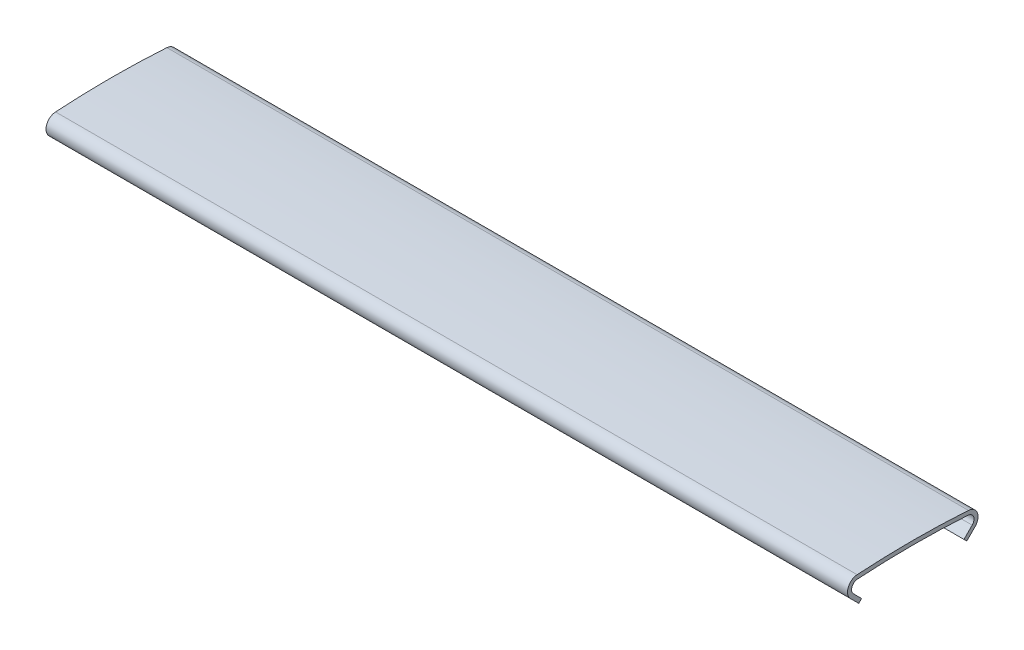
ISO-10303-21;
HEADER;
FILE_DESCRIPTION(('STEP AP214'),'2;1');
FILE_NAME('part.step','',(''),(''),'','','');
FILE_SCHEMA(('AUTOMOTIVE_DESIGN { 1 0 10303 214 1 1 1 1 }'));
ENDSEC;
DATA;
#1=APPLICATION_CONTEXT('core data for automotive mechanical design processes');
#2=APPLICATION_PROTOCOL_DEFINITION('international standard','automotive_design',2000,#1);
#3=PRODUCT_CONTEXT('',#1,'mechanical');
#4=PRODUCT('Part','Part','',(#3));
#5=PRODUCT_RELATED_PRODUCT_CATEGORY('part','',(#4));
#6=PRODUCT_DEFINITION_FORMATION('','',#4);
#7=PRODUCT_DEFINITION_CONTEXT('part definition',#1,'design');
#8=PRODUCT_DEFINITION('design','',#6,#7);
#9=PRODUCT_DEFINITION_SHAPE('','',#8);
#10=(LENGTH_UNIT() NAMED_UNIT(*) SI_UNIT(.MILLI.,.METRE.));
#11=(NAMED_UNIT(*) PLANE_ANGLE_UNIT() SI_UNIT($,.RADIAN.));
#12=(NAMED_UNIT(*) SI_UNIT($,.STERADIAN.) SOLID_ANGLE_UNIT());
#13=UNCERTAINTY_MEASURE_WITH_UNIT(LENGTH_MEASURE(1.E-05),#10,'distance_accuracy_value','');
#14=(GEOMETRIC_REPRESENTATION_CONTEXT(3) GLOBAL_UNCERTAINTY_ASSIGNED_CONTEXT((#13)) GLOBAL_UNIT_ASSIGNED_CONTEXT((#10,
#11,#12)) REPRESENTATION_CONTEXT('',''));
#15=CARTESIAN_POINT('',(0.,0.,0.));
#16=DIRECTION('',(0.,0.,1.));
#17=DIRECTION('',(1.,0.,0.));
#18=AXIS2_PLACEMENT_3D('',#15,#16,#17);
#19=CARTESIAN_POINT('',(43.,-1.29000028204481,5.90147308199342));
#20=DIRECTION('',(-1.,0.,0.));
#21=DIRECTION('',(0.,0.,1.));
#22=AXIS2_PLACEMENT_3D('',#19,#20,#21);
#23=CYLINDRICAL_SURFACE('',#22,0.668526918006594);
#24=CARTESIAN_POINT('',(-43.,-1.29000028204481,5.90147308199342));
#25=DIRECTION('',(-1.,0.,0.));
#26=DIRECTION('',(0.,0.,-1.));
#27=AXIS2_PLACEMENT_3D('',#24,#25,#26);
#28=CIRCLE('',#27,0.668526918006594);
#29=CARTESIAN_POINT('',(-43.,-1.76272019917301,6.37419299912162));
#30=VERTEX_POINT('',#29);
#31=CARTESIAN_POINT('',(-43.,-0.622879372182208,5.94480819158711));
#32=VERTEX_POINT('',#31);
#33=EDGE_CURVE('E155',#30,#32,#28,.T.);
#34=ORIENTED_EDGE('',*,*,#33,.T.);
#35=DIRECTION('',(-1.,0.,0.));
#36=VECTOR('',#35,1.);
#37=CARTESIAN_POINT('',(43.,-0.622879372182208,5.94480819158711));
#38=LINE('',#37,#36);
#39=CARTESIAN_POINT('',(43.,-0.622879372182208,5.94480819158711));
#40=VERTEX_POINT('',#39);
#41=EDGE_CURVE('E11',#40,#32,#38,.T.);
#42=ORIENTED_EDGE('',*,*,#41,.F.);
#43=CARTESIAN_POINT('',(43.,-1.29000028204481,5.90147308199342));
#44=DIRECTION('',(-1.,0.,0.));
#45=DIRECTION('',(0.,0.,-1.));
#46=AXIS2_PLACEMENT_3D('',#43,#44,#45);
#47=CIRCLE('',#46,0.668526918006594);
#48=CARTESIAN_POINT('',(43.,-1.76272019917301,6.37419299912162));
#49=VERTEX_POINT('',#48);
#50=EDGE_CURVE('E177',#49,#40,#47,.T.);
#51=ORIENTED_EDGE('',*,*,#50,.F.);
#52=DIRECTION('',(-1.,0.,0.));
#53=VECTOR('',#52,1.);
#54=CARTESIAN_POINT('',(43.,-1.76272019917301,6.37419299912162));
#55=LINE('',#54,#53);
#56=EDGE_CURVE('E151',#49,#30,#55,.T.);
#57=ORIENTED_EDGE('',*,*,#56,.T.);
#58=EDGE_LOOP('',(#34,#42,#51,#57));
#59=FACE_BOUND('',#58,.T.);
#60=ADVANCED_FACE('F35',(#59),#23,.F.);
#61=CARTESIAN_POINT('',(43.,-92.1400322515474,0.));
#62=DIRECTION('',(-1.,0.,0.));
#63=DIRECTION('',(0.,0.,1.));
#64=AXIS2_PLACEMENT_3D('',#61,#62,#63);
#65=CYLINDRICAL_SURFACE('',#64,91.7100322515474);
#66=CARTESIAN_POINT('',(-43.,-92.1400322515474,0.));
#67=DIRECTION('',(-1.,0.,0.));
#68=DIRECTION('',(0.,0.,-1.));
#69=AXIS2_PLACEMENT_3D('',#66,#67,#68);
#70=CIRCLE('',#69,91.7100322515474);
#71=CARTESIAN_POINT('',(-43.,-0.622879372182208,-5.9448081915871));
#72=VERTEX_POINT('',#71);
#73=EDGE_CURVE('E158',#32,#72,#70,.T.);
#74=ORIENTED_EDGE('',*,*,#73,.T.);
#75=DIRECTION('',(-1.,0.,0.));
#76=VECTOR('',#75,1.);
#77=CARTESIAN_POINT('',(43.,-0.622879372182208,-5.9448081915871));
#78=LINE('',#77,#76);
#79=CARTESIAN_POINT('',(43.,-0.622879372182208,-5.9448081915871));
#80=VERTEX_POINT('',#79);
#81=EDGE_CURVE('E43',#80,#72,#78,.T.);
#82=ORIENTED_EDGE('',*,*,#81,.F.);
#83=CARTESIAN_POINT('',(43.,-92.1400322515474,0.));
#84=DIRECTION('',(-1.,0.,0.));
#85=DIRECTION('',(0.,0.,-1.));
#86=AXIS2_PLACEMENT_3D('',#83,#84,#85);
#87=CIRCLE('',#86,91.7100322515474);
#88=EDGE_CURVE('E106',#40,#80,#87,.T.);
#89=ORIENTED_EDGE('',*,*,#88,.F.);
#90=ORIENTED_EDGE('',*,*,#41,.T.);
#91=EDGE_LOOP('',(#74,#82,#89,#90));
#92=FACE_BOUND('',#91,.T.);
#93=ADVANCED_FACE('F255',(#92),#65,.F.);
#94=CARTESIAN_POINT('',(43.,-1.29000028204481,-5.90147308199342));
#95=DIRECTION('',(-1.,0.,0.));
#96=DIRECTION('',(0.,0.,1.));
#97=AXIS2_PLACEMENT_3D('',#94,#95,#96);
#98=CYLINDRICAL_SURFACE('',#97,0.668526918006593);
#99=CARTESIAN_POINT('',(-43.,-1.29000028204481,-5.90147308199342));
#100=DIRECTION('',(-1.,0.,0.));
#101=DIRECTION('',(0.,0.,-1.));
#102=AXIS2_PLACEMENT_3D('',#99,#100,#101);
#103=CIRCLE('',#102,0.668526918006593);
#104=CARTESIAN_POINT('',(-43.,-1.76272019917301,-6.37419299912162));
#105=VERTEX_POINT('',#104);
#106=EDGE_CURVE('E160',#72,#105,#103,.T.);
#107=ORIENTED_EDGE('',*,*,#106,.T.);
#108=DIRECTION('',(-1.,0.,0.));
#109=VECTOR('',#108,1.);
#110=CARTESIAN_POINT('',(43.,-1.76272019917301,-6.37419299912162));
#111=LINE('',#110,#109);
#112=CARTESIAN_POINT('',(43.,-1.76272019917301,-6.37419299912162));
#113=VERTEX_POINT('',#112);
#114=EDGE_CURVE('E196',#113,#105,#111,.T.);
#115=ORIENTED_EDGE('',*,*,#114,.F.);
#116=CARTESIAN_POINT('',(43.,-1.29000028204481,-5.90147308199342));
#117=DIRECTION('',(-1.,0.,0.));
#118=DIRECTION('',(0.,0.,-1.));
#119=AXIS2_PLACEMENT_3D('',#116,#117,#118);
#120=CIRCLE('',#119,0.668526918006593);
#121=EDGE_CURVE('E204',#80,#113,#120,.T.);
#122=ORIENTED_EDGE('',*,*,#121,.F.);
#123=ORIENTED_EDGE('',*,*,#81,.T.);
#124=EDGE_LOOP('',(#107,#115,#122,#123));
#125=FACE_BOUND('',#124,.T.);
#126=ADVANCED_FACE('F202',(#125),#98,.F.);
#127=CARTESIAN_POINT('',(43.,-2.6474230348458,-5.48949016344883));
#128=DIRECTION('',(0.,-0.707106781186547,-0.707106781186548));
#129=DIRECTION('',(0.,0.707106781186548,-0.707106781186547));
#130=AXIS2_PLACEMENT_3D('',#127,#128,#129);
#131=PLANE('',#130);
#132=DIRECTION('',(0.,-0.707106781186548,0.707106781186547));
#133=VECTOR('',#132,1.);
#134=CARTESIAN_POINT('',(-43.,-2.6474230348458,-5.48949016344883));
#135=LINE('',#134,#133);
#136=CARTESIAN_POINT('',(-43.,-2.6474230348458,-5.48949016344883));
#137=VERTEX_POINT('',#136);
#138=EDGE_CURVE('E162',#105,#137,#135,.T.);
#139=ORIENTED_EDGE('',*,*,#138,.T.);
#140=DIRECTION('',(-1.,0.,0.));
#141=VECTOR('',#140,1.);
#142=CARTESIAN_POINT('',(43.,-2.6474230348458,-5.48949016344883));
#143=LINE('',#142,#141);
#144=CARTESIAN_POINT('',(43.,-2.6474230348458,-5.48949016344883));
#145=VERTEX_POINT('',#144);
#146=EDGE_CURVE('E193',#145,#137,#143,.T.);
#147=ORIENTED_EDGE('',*,*,#146,.F.);
#148=DIRECTION('',(0.,-0.707106781186548,0.707106781186547));
#149=VECTOR('',#148,1.);
#150=CARTESIAN_POINT('',(43.,-2.6474230348458,-5.48949016344883));
#151=LINE('',#150,#149);
#152=EDGE_CURVE('E222',#113,#145,#151,.T.);
#153=ORIENTED_EDGE('',*,*,#152,.F.);
#154=ORIENTED_EDGE('',*,*,#114,.T.);
#155=EDGE_LOOP('',(#139,#147,#153,#154));
#156=FACE_BOUND('',#155,.T.);
#157=ADVANCED_FACE('F213',(#156),#131,.F.);
#158=CARTESIAN_POINT('',(43.,-2.95147895075601,-5.79354607935904));
#159=DIRECTION('',(0.,0.707106781186548,-0.707106781186547));
#160=DIRECTION('',(0.,0.707106781186547,0.707106781186548));
#161=AXIS2_PLACEMENT_3D('',#158,#159,#160);
#162=PLANE('',#161);
#163=DIRECTION('',(0.,-0.707106781186547,-0.707106781186548));
#164=VECTOR('',#163,1.);
#165=CARTESIAN_POINT('',(-43.,-2.95147895075601,-5.79354607935904));
#166=LINE('',#165,#164);
#167=CARTESIAN_POINT('',(-43.,-2.95147895075601,-5.79354607935904));
#168=VERTEX_POINT('',#167);
#169=EDGE_CURVE('E164',#137,#168,#166,.T.);
#170=ORIENTED_EDGE('',*,*,#169,.T.);
#171=DIRECTION('',(-1.,0.,0.));
#172=VECTOR('',#171,1.);
#173=CARTESIAN_POINT('',(43.,-2.95147895075601,-5.79354607935904));
#174=LINE('',#173,#172);
#175=CARTESIAN_POINT('',(43.,-2.95147895075601,-5.79354607935904));
#176=VERTEX_POINT('',#175);
#177=EDGE_CURVE('E190',#176,#168,#174,.T.);
#178=ORIENTED_EDGE('',*,*,#177,.F.);
#179=DIRECTION('',(0.,-0.707106781186547,-0.707106781186548));
#180=VECTOR('',#179,1.);
#181=CARTESIAN_POINT('',(43.,-2.95147895075601,-5.79354607935904));
#182=LINE('',#181,#180);
#183=EDGE_CURVE('E219',#145,#176,#182,.T.);
#184=ORIENTED_EDGE('',*,*,#183,.F.);
#185=ORIENTED_EDGE('',*,*,#146,.T.);
#186=EDGE_LOOP('',(#170,#178,#184,#185));
#187=FACE_BOUND('',#186,.T.);
#188=ADVANCED_FACE('F217',(#187),#162,.F.);
#189=CARTESIAN_POINT('',(43.,-2.06677611508322,-6.67824891503183));
#190=DIRECTION('',(0.,0.707106781186548,0.707106781186547));
#191=DIRECTION('',(0.,-0.707106781186547,0.707106781186548));
#192=AXIS2_PLACEMENT_3D('',#189,#190,#191);
#193=PLANE('',#192);
#194=DIRECTION('',(0.,0.707106781186547,-0.707106781186548));
#195=VECTOR('',#194,1.);
#196=CARTESIAN_POINT('',(-43.,-2.06677611508322,-6.67824891503183));
#197=LINE('',#196,#195);
#198=CARTESIAN_POINT('',(-43.,-2.06677611508322,-6.67824891503183));
#199=VERTEX_POINT('',#198);
#200=EDGE_CURVE('E166',#168,#199,#197,.T.);
#201=ORIENTED_EDGE('',*,*,#200,.T.);
#202=DIRECTION('',(-1.,0.,0.));
#203=VECTOR('',#202,1.);
#204=CARTESIAN_POINT('',(43.,-2.06677611508322,-6.67824891503183));
#205=LINE('',#204,#203);
#206=CARTESIAN_POINT('',(43.,-2.06677611508322,-6.67824891503183));
#207=VERTEX_POINT('',#206);
#208=EDGE_CURVE('E187',#207,#199,#205,.T.);
#209=ORIENTED_EDGE('',*,*,#208,.F.);
#210=DIRECTION('',(0.,0.707106781186547,-0.707106781186548));
#211=VECTOR('',#210,1.);
#212=CARTESIAN_POINT('',(43.,-2.06677611508322,-6.67824891503183));
#213=LINE('',#212,#211);
#214=EDGE_CURVE('E221',#176,#207,#213,.T.);
#215=ORIENTED_EDGE('',*,*,#214,.F.);
#216=ORIENTED_EDGE('',*,*,#177,.T.);
#217=EDGE_LOOP('',(#201,#209,#215,#216));
#218=FACE_BOUND('',#217,.T.);
#219=ADVANCED_FACE('F268',(#218),#193,.F.);
#220=CARTESIAN_POINT('',(43.,-1.29000028204481,-5.90147308199342));
#221=DIRECTION('',(-1.,0.,0.));
#222=DIRECTION('',(0.,0.,1.));
#223=AXIS2_PLACEMENT_3D('',#220,#221,#222);
#224=CYLINDRICAL_SURFACE('',#223,1.09852691800658);
#225=CARTESIAN_POINT('',(-43.,-1.29000028204481,-5.90147308199342));
#226=DIRECTION('',(1.,0.,0.));
#227=DIRECTION('',(0.,0.,-1.));
#228=AXIS2_PLACEMENT_3D('',#225,#226,#227);
#229=CIRCLE('',#228,1.09852691800658);
#230=CARTESIAN_POINT('',(-43.,-0.193783723952711,-5.97268156006845));
#231=VERTEX_POINT('',#230);
#232=EDGE_CURVE('E168',#199,#231,#229,.T.);
#233=ORIENTED_EDGE('',*,*,#232,.T.);
#234=DIRECTION('',(-1.,0.,0.));
#235=VECTOR('',#234,1.);
#236=CARTESIAN_POINT('',(43.,-0.193783723952711,-5.97268156006845));
#237=LINE('',#236,#235);
#238=CARTESIAN_POINT('',(43.,-0.193783723952711,-5.97268156006845));
#239=VERTEX_POINT('',#238);
#240=EDGE_CURVE('E184',#239,#231,#237,.T.);
#241=ORIENTED_EDGE('',*,*,#240,.F.);
#242=CARTESIAN_POINT('',(43.,-1.29000028204481,-5.90147308199342));
#243=DIRECTION('',(1.,0.,0.));
#244=DIRECTION('',(0.,0.,-1.));
#245=AXIS2_PLACEMENT_3D('',#242,#243,#244);
#246=CIRCLE('',#245,1.09852691800658);
#247=EDGE_CURVE('E224',#207,#239,#246,.T.);
#248=ORIENTED_EDGE('',*,*,#247,.F.);
#249=ORIENTED_EDGE('',*,*,#208,.T.);
#250=EDGE_LOOP('',(#233,#241,#248,#249));
#251=FACE_BOUND('',#250,.T.);
#252=ADVANCED_FACE('F271',(#251),#224,.T.);
#253=CARTESIAN_POINT('',(43.,-92.1400322515474,0.));
#254=DIRECTION('',(-1.,0.,0.));
#255=DIRECTION('',(0.,0.,1.));
#256=AXIS2_PLACEMENT_3D('',#253,#254,#255);
#257=CYLINDRICAL_SURFACE('',#256,92.1400322515474);
#258=CARTESIAN_POINT('',(-43.,-92.1400322515474,0.));
#259=DIRECTION('',(1.,0.,0.));
#260=DIRECTION('',(0.,0.,-1.));
#261=AXIS2_PLACEMENT_3D('',#258,#259,#260);
#262=CIRCLE('',#261,92.1400322515474);
#263=CARTESIAN_POINT('',(-43.,-0.193783723952692,5.97268156006845));
#264=VERTEX_POINT('',#263);
#265=EDGE_CURVE('E170',#231,#264,#262,.T.);
#266=ORIENTED_EDGE('',*,*,#265,.T.);
#267=DIRECTION('',(-1.,0.,0.));
#268=VECTOR('',#267,1.);
#269=CARTESIAN_POINT('',(43.,-0.193783723952692,5.97268156006845));
#270=LINE('',#269,#268);
#271=CARTESIAN_POINT('',(43.,-0.193783723952692,5.97268156006845));
#272=VERTEX_POINT('',#271);
#273=EDGE_CURVE('E181',#272,#264,#270,.T.);
#274=ORIENTED_EDGE('',*,*,#273,.F.);
#275=CARTESIAN_POINT('',(43.,-92.1400322515474,0.));
#276=DIRECTION('',(1.,0.,0.));
#277=DIRECTION('',(0.,0.,-1.));
#278=AXIS2_PLACEMENT_3D('',#275,#276,#277);
#279=CIRCLE('',#278,92.1400322515474);
#280=EDGE_CURVE('E230',#239,#272,#279,.T.);
#281=ORIENTED_EDGE('',*,*,#280,.F.);
#282=ORIENTED_EDGE('',*,*,#240,.T.);
#283=EDGE_LOOP('',(#266,#274,#281,#282));
#284=FACE_BOUND('',#283,.T.);
#285=ADVANCED_FACE('F236',(#284),#257,.T.);
#286=CARTESIAN_POINT('',(43.,-1.29000028204481,5.90147308199342));
#287=DIRECTION('',(-1.,0.,0.));
#288=DIRECTION('',(0.,0.,1.));
#289=AXIS2_PLACEMENT_3D('',#286,#287,#288);
#290=CYLINDRICAL_SURFACE('',#289,1.09852691800658);
#291=CARTESIAN_POINT('',(-43.,-1.29000028204481,5.90147308199342));
#292=DIRECTION('',(1.,0.,0.));
#293=DIRECTION('',(0.,0.,-1.));
#294=AXIS2_PLACEMENT_3D('',#291,#292,#293);
#295=CIRCLE('',#294,1.09852691800658);
#296=CARTESIAN_POINT('',(-43.,-2.06677611508322,6.67824891503183));
#297=VERTEX_POINT('',#296);
#298=EDGE_CURVE('E172',#264,#297,#295,.T.);
#299=ORIENTED_EDGE('',*,*,#298,.T.);
#300=DIRECTION('',(-1.,0.,0.));
#301=VECTOR('',#300,1.);
#302=CARTESIAN_POINT('',(43.,-2.06677611508322,6.67824891503183));
#303=LINE('',#302,#301);
#304=CARTESIAN_POINT('',(43.,-2.06677611508322,6.67824891503183));
#305=VERTEX_POINT('',#304);
#306=EDGE_CURVE('E146',#305,#297,#303,.T.);
#307=ORIENTED_EDGE('',*,*,#306,.F.);
#308=CARTESIAN_POINT('',(43.,-1.29000028204481,5.90147308199342));
#309=DIRECTION('',(1.,0.,0.));
#310=DIRECTION('',(0.,0.,-1.));
#311=AXIS2_PLACEMENT_3D('',#308,#309,#310);
#312=CIRCLE('',#311,1.09852691800658);
#313=EDGE_CURVE('E137',#272,#305,#312,.T.);
#314=ORIENTED_EDGE('',*,*,#313,.F.);
#315=ORIENTED_EDGE('',*,*,#273,.T.);
#316=EDGE_LOOP('',(#299,#307,#314,#315));
#317=FACE_BOUND('',#316,.T.);
#318=ADVANCED_FACE('F240',(#317),#290,.T.);
#319=CARTESIAN_POINT('',(43.,-2.06677611508322,6.67824891503183));
#320=DIRECTION('',(0.,0.707106781186547,-0.707106781186548));
#321=DIRECTION('',(0.,0.707106781186548,0.707106781186547));
#322=AXIS2_PLACEMENT_3D('',#319,#320,#321);
#323=PLANE('',#322);
#324=DIRECTION('',(0.,-0.707106781186548,-0.707106781186547));
#325=VECTOR('',#324,1.);
#326=CARTESIAN_POINT('',(-43.,-2.06677611508322,6.67824891503183));
#327=LINE('',#326,#325);
#328=CARTESIAN_POINT('',(-43.,-2.95147895075601,5.79354607935904));
#329=VERTEX_POINT('',#328);
#330=EDGE_CURVE('E145',#297,#329,#327,.T.);
#331=ORIENTED_EDGE('',*,*,#330,.T.);
#332=DIRECTION('',(-1.,0.,0.));
#333=VECTOR('',#332,1.);
#334=CARTESIAN_POINT('',(43.,-2.95147895075601,5.79354607935904));
#335=LINE('',#334,#333);
#336=CARTESIAN_POINT('',(43.,-2.95147895075601,5.79354607935904));
#337=VERTEX_POINT('',#336);
#338=EDGE_CURVE('E142',#337,#329,#335,.T.);
#339=ORIENTED_EDGE('',*,*,#338,.F.);
#340=DIRECTION('',(0.,-0.707106781186548,-0.707106781186547));
#341=VECTOR('',#340,1.);
#342=CARTESIAN_POINT('',(43.,-2.06677611508322,6.67824891503183));
#343=LINE('',#342,#341);
#344=EDGE_CURVE('E131',#305,#337,#343,.T.);
#345=ORIENTED_EDGE('',*,*,#344,.F.);
#346=ORIENTED_EDGE('',*,*,#306,.T.);
#347=EDGE_LOOP('',(#331,#339,#345,#346));
#348=FACE_BOUND('',#347,.T.);
#349=ADVANCED_FACE('F143',(#348),#323,.F.);
#350=CARTESIAN_POINT('',(43.,-2.95147895075601,5.79354607935904));
#351=DIRECTION('',(0.,0.707106781186547,0.707106781186548));
#352=DIRECTION('',(0.,-0.707106781186548,0.707106781186547));
#353=AXIS2_PLACEMENT_3D('',#350,#351,#352);
#354=PLANE('',#353);
#355=DIRECTION('',(0.,0.707106781186548,-0.707106781186547));
#356=VECTOR('',#355,1.);
#357=CARTESIAN_POINT('',(-43.,-2.95147895075601,5.79354607935904));
#358=LINE('',#357,#356);
#359=CARTESIAN_POINT('',(-43.,-2.6474230348458,5.48949016344883));
#360=VERTEX_POINT('',#359);
#361=EDGE_CURVE('E92',#329,#360,#358,.T.);
#362=ORIENTED_EDGE('',*,*,#361,.T.);
#363=DIRECTION('',(-1.,0.,0.));
#364=VECTOR('',#363,1.);
#365=CARTESIAN_POINT('',(43.,-2.6474230348458,5.48949016344883));
#366=LINE('',#365,#364);
#367=CARTESIAN_POINT('',(43.,-2.6474230348458,5.48949016344883));
#368=VERTEX_POINT('',#367);
#369=EDGE_CURVE('E147',#368,#360,#366,.T.);
#370=ORIENTED_EDGE('',*,*,#369,.F.);
#371=DIRECTION('',(0.,0.707106781186548,-0.707106781186547));
#372=VECTOR('',#371,1.);
#373=CARTESIAN_POINT('',(43.,-2.95147895075601,5.79354607935904));
#374=LINE('',#373,#372);
#375=EDGE_CURVE('E135',#337,#368,#374,.T.);
#376=ORIENTED_EDGE('',*,*,#375,.F.);
#377=ORIENTED_EDGE('',*,*,#338,.T.);
#378=EDGE_LOOP('',(#362,#370,#376,#377));
#379=FACE_BOUND('',#378,.T.);
#380=ADVANCED_FACE('F149',(#379),#354,.F.);
#381=CARTESIAN_POINT('',(43.,-2.6474230348458,5.48949016344883));
#382=DIRECTION('',(0.,-0.707106781186547,0.707106781186548));
#383=DIRECTION('',(0.,-0.707106781186548,-0.707106781186547));
#384=AXIS2_PLACEMENT_3D('',#381,#382,#383);
#385=PLANE('',#384);
#386=DIRECTION('',(0.,0.707106781186548,0.707106781186547));
#387=VECTOR('',#386,1.);
#388=CARTESIAN_POINT('',(-43.,-2.6474230348458,5.48949016344883));
#389=LINE('',#388,#387);
#390=EDGE_CURVE('E98',#360,#30,#389,.T.);
#391=ORIENTED_EDGE('',*,*,#390,.T.);
#392=ORIENTED_EDGE('',*,*,#56,.F.);
#393=DIRECTION('',(0.,0.707106781186548,0.707106781186547));
#394=VECTOR('',#393,1.);
#395=CARTESIAN_POINT('',(43.,-2.6474230348458,5.48949016344883));
#396=LINE('',#395,#394);
#397=EDGE_CURVE('E51',#368,#49,#396,.T.);
#398=ORIENTED_EDGE('',*,*,#397,.F.);
#399=ORIENTED_EDGE('',*,*,#369,.T.);
#400=EDGE_LOOP('',(#391,#392,#398,#399));
#401=FACE_BOUND('',#400,.T.);
#402=ADVANCED_FACE('F244',(#401),#385,.F.);
#403=CARTESIAN_POINT('',(43.,-1.29000028204481,5.90147308199342));
#404=DIRECTION('',(1.,0.,0.));
#405=DIRECTION('',(0.,0.,-1.));
#406=AXIS2_PLACEMENT_3D('',#403,#404,#405);
#407=PLANE('',#406);
#408=ORIENTED_EDGE('',*,*,#50,.T.);
#409=ORIENTED_EDGE('',*,*,#88,.T.);
#410=ORIENTED_EDGE('',*,*,#121,.T.);
#411=ORIENTED_EDGE('',*,*,#152,.T.);
#412=ORIENTED_EDGE('',*,*,#183,.T.);
#413=ORIENTED_EDGE('',*,*,#214,.T.);
#414=ORIENTED_EDGE('',*,*,#247,.T.);
#415=ORIENTED_EDGE('',*,*,#280,.T.);
#416=ORIENTED_EDGE('',*,*,#313,.T.);
#417=ORIENTED_EDGE('',*,*,#344,.T.);
#418=ORIENTED_EDGE('',*,*,#375,.T.);
#419=ORIENTED_EDGE('',*,*,#397,.T.);
#420=EDGE_LOOP('',(#408,#409,#410,#411,#412,#413,#414,#415,#416,#417,#418,#419));
#421=FACE_BOUND('',#420,.T.);
#422=ADVANCED_FACE('F133',(#421),#407,.T.);
#423=CARTESIAN_POINT('',(-43.,-1.29000028204481,5.90147308199342));
#424=DIRECTION('',(1.,0.,0.));
#425=DIRECTION('',(0.,0.,-1.));
#426=AXIS2_PLACEMENT_3D('',#423,#424,#425);
#427=PLANE('',#426);
#428=ORIENTED_EDGE('',*,*,#33,.F.);
#429=ORIENTED_EDGE('',*,*,#390,.F.);
#430=ORIENTED_EDGE('',*,*,#361,.F.);
#431=ORIENTED_EDGE('',*,*,#330,.F.);
#432=ORIENTED_EDGE('',*,*,#298,.F.);
#433=ORIENTED_EDGE('',*,*,#265,.F.);
#434=ORIENTED_EDGE('',*,*,#232,.F.);
#435=ORIENTED_EDGE('',*,*,#200,.F.);
#436=ORIENTED_EDGE('',*,*,#169,.F.);
#437=ORIENTED_EDGE('',*,*,#138,.F.);
#438=ORIENTED_EDGE('',*,*,#106,.F.);
#439=ORIENTED_EDGE('',*,*,#73,.F.);
#440=EDGE_LOOP('',(#428,#429,#430,#431,#432,#433,#434,#435,#436,#437,#438,#439));
#441=FACE_BOUND('',#440,.T.);
#442=ADVANCED_FACE('F208',(#441),#427,.F.);
#443=CLOSED_SHELL('',(#60,#93,#126,#157,#188,#219,#252,#285,#318,#349,#380,#402,#422,#442));
#444=MANIFOLD_SOLID_BREP('B2',#443);
#445=ADVANCED_BREP_SHAPE_REPRESENTATION('',(#18,#444),#14);
#446=SHAPE_DEFINITION_REPRESENTATION(#9,#445);
ENDSEC;
END-ISO-10303-21;
